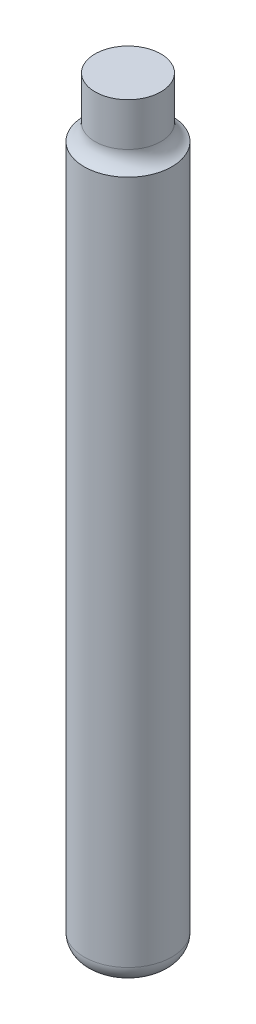
ISO-10303-21;
HEADER;
FILE_DESCRIPTION(('STEP AP214'),'2;1');
FILE_NAME('part.step','',(''),(''),'','','');
FILE_SCHEMA(('AUTOMOTIVE_DESIGN { 1 0 10303 214 1 1 1 1 }'));
ENDSEC;
DATA;
#1=APPLICATION_CONTEXT('core data for automotive mechanical design processes');
#2=APPLICATION_PROTOCOL_DEFINITION('international standard','automotive_design',2000,#1);
#3=PRODUCT_CONTEXT('',#1,'mechanical');
#4=PRODUCT('Part','Part','',(#3));
#5=PRODUCT_RELATED_PRODUCT_CATEGORY('part','',(#4));
#6=PRODUCT_DEFINITION_FORMATION('','',#4);
#7=PRODUCT_DEFINITION_CONTEXT('part definition',#1,'design');
#8=PRODUCT_DEFINITION('design','',#6,#7);
#9=PRODUCT_DEFINITION_SHAPE('','',#8);
#10=(LENGTH_UNIT() NAMED_UNIT(*) SI_UNIT(.MILLI.,.METRE.));
#11=(NAMED_UNIT(*) PLANE_ANGLE_UNIT() SI_UNIT($,.RADIAN.));
#12=(NAMED_UNIT(*) SI_UNIT($,.STERADIAN.) SOLID_ANGLE_UNIT());
#13=UNCERTAINTY_MEASURE_WITH_UNIT(LENGTH_MEASURE(1.E-05),#10,'distance_accuracy_value','');
#14=(GEOMETRIC_REPRESENTATION_CONTEXT(3) GLOBAL_UNCERTAINTY_ASSIGNED_CONTEXT((#13)) GLOBAL_UNIT_ASSIGNED_CONTEXT((#10,
#11,#12)) REPRESENTATION_CONTEXT('',''));
#15=CARTESIAN_POINT('',(0.,0.,0.));
#16=DIRECTION('',(0.,0.,1.));
#17=DIRECTION('',(1.,0.,0.));
#18=AXIS2_PLACEMENT_3D('',#15,#16,#17);
#19=CARTESIAN_POINT('',(0.,50.8,0.));
#20=DIRECTION('',(0.,-1.,0.));
#21=DIRECTION('',(0.,0.,-1.));
#22=AXIS2_PLACEMENT_3D('',#19,#20,#21);
#23=CYLINDRICAL_SURFACE('',#22,3.175);
#24=CARTESIAN_POINT('',(0.,1.27,0.));
#25=DIRECTION('',(0.,1.,0.));
#26=DIRECTION('',(0.,0.,1.));
#27=AXIS2_PLACEMENT_3D('',#24,#25,#26);
#28=CIRCLE('',#27,3.175);
#29=CARTESIAN_POINT('',(0.,1.27,3.175));
#30=VERTEX_POINT('',#29);
#31=EDGE_CURVE('E51',#30,#30,#28,.T.);
#32=ORIENTED_EDGE('',*,*,#31,.T.);
#33=EDGE_LOOP('',(#32));
#34=FACE_BOUND('',#33,.T.);
#35=CARTESIAN_POINT('',(0.,50.8,0.));
#36=DIRECTION('',(0.,1.,0.));
#37=DIRECTION('',(0.,0.,1.));
#38=AXIS2_PLACEMENT_3D('',#35,#36,#37);
#39=CIRCLE('',#38,3.175);
#40=CARTESIAN_POINT('',(0.,50.8,3.175));
#41=VERTEX_POINT('',#40);
#42=EDGE_CURVE('E48',#41,#41,#39,.T.);
#43=ORIENTED_EDGE('',*,*,#42,.F.);
#44=EDGE_LOOP('',(#43));
#45=FACE_BOUND('',#44,.T.);
#46=ADVANCED_FACE('F34',(#34,#45),#23,.T.);
#47=CARTESIAN_POINT('',(0.,0.,0.));
#48=DIRECTION('',(0.,1.,0.));
#49=DIRECTION('',(0.,0.,1.));
#50=AXIS2_PLACEMENT_3D('',#47,#48,#49);
#51=PLANE('',#50);
#52=CARTESIAN_POINT('',(0.,0.,0.));
#53=DIRECTION('',(0.,1.,0.));
#54=DIRECTION('',(0.,0.,1.));
#55=AXIS2_PLACEMENT_3D('',#52,#53,#54);
#56=CIRCLE('',#55,1.905);
#57=CARTESIAN_POINT('',(0.,0.,1.905));
#58=VERTEX_POINT('',#57);
#59=EDGE_CURVE('E41',#58,#58,#56,.F.);
#60=ORIENTED_EDGE('',*,*,#59,.T.);
#61=EDGE_LOOP('',(#60));
#62=FACE_BOUND('',#61,.T.);
#63=ADVANCED_FACE('F58',(#62),#51,.F.);
#64=CARTESIAN_POINT('',(0.,1.27,0.));
#65=DIRECTION('',(0.,1.,0.));
#66=DIRECTION('',(0.,0.,1.));
#67=AXIS2_PLACEMENT_3D('',#64,#65,#66);
#68=TOROIDAL_SURFACE('',#67,1.905,1.27);
#69=ORIENTED_EDGE('',*,*,#59,.F.);
#70=EDGE_LOOP('',(#69));
#71=FACE_BOUND('',#70,.T.);
#72=ORIENTED_EDGE('',*,*,#31,.F.);
#73=EDGE_LOOP('',(#72));
#74=FACE_BOUND('',#73,.T.);
#75=ADVANCED_FACE('F60',(#71,#74),#68,.T.);
#76=CARTESIAN_POINT('',(0.,55.0959623068477,0.));
#77=DIRECTION('',(0.,1.,0.));
#78=DIRECTION('',(0.,0.,1.));
#79=AXIS2_PLACEMENT_3D('',#76,#77,#78);
#80=PLANE('',#79);
#81=CARTESIAN_POINT('',(0.,55.0959623068477,0.));
#82=DIRECTION('',(0.,1.,0.));
#83=DIRECTION('',(0.,0.,1.));
#84=AXIS2_PLACEMENT_3D('',#81,#82,#83);
#85=CIRCLE('',#84,2.38125);
#86=CARTESIAN_POINT('',(0.,55.0959623068477,2.38125));
#87=VERTEX_POINT('',#86);
#88=EDGE_CURVE('E45',#87,#87,#85,.T.);
#89=ORIENTED_EDGE('',*,*,#88,.T.);
#90=EDGE_LOOP('',(#89));
#91=FACE_BOUND('',#90,.T.);
#92=ADVANCED_FACE('F46',(#91),#80,.T.);
#93=CARTESIAN_POINT('',(0.,50.8,0.));
#94=DIRECTION('',(0.,1.,0.));
#95=DIRECTION('',(0.,0.,1.));
#96=AXIS2_PLACEMENT_3D('',#93,#94,#95);
#97=CYLINDRICAL_SURFACE('',#96,2.38125);
#98=CARTESIAN_POINT('',(0.,51.9773215098264,0.));
#99=DIRECTION('',(0.,-1.,0.));
#100=DIRECTION('',(0.,0.,-1.));
#101=AXIS2_PLACEMENT_3D('',#98,#99,#100);
#102=CIRCLE('',#101,2.38125);
#103=CARTESIAN_POINT('',(0.,51.9773215098264,-2.38125));
#104=VERTEX_POINT('',#103);
#105=EDGE_CURVE('E11',#104,#104,#102,.F.);
#106=ORIENTED_EDGE('',*,*,#105,.T.);
#107=EDGE_LOOP('',(#106));
#108=FACE_BOUND('',#107,.T.);
#109=ORIENTED_EDGE('',*,*,#88,.F.);
#110=EDGE_LOOP('',(#109));
#111=FACE_BOUND('',#110,.T.);
#112=ADVANCED_FACE('F63',(#108,#111),#97,.T.);
#113=CARTESIAN_POINT('',(0.,51.9773215098264,0.));
#114=DIRECTION('',(0.,-1.,0.));
#115=DIRECTION('',(0.,0.,-1.));
#116=AXIS2_PLACEMENT_3D('',#113,#114,#115);
#117=TOROIDAL_SURFACE('',#116,3.65125,1.27);
#118=ORIENTED_EDGE('',*,*,#42,.T.);
#119=EDGE_LOOP('',(#118));
#120=FACE_BOUND('',#119,.T.);
#121=ORIENTED_EDGE('',*,*,#105,.F.);
#122=EDGE_LOOP('',(#121));
#123=FACE_BOUND('',#122,.T.);
#124=ADVANCED_FACE('F36',(#120,#123),#117,.F.);
#125=CLOSED_SHELL('',(#46,#63,#75,#92,#112,#124));
#126=MANIFOLD_SOLID_BREP('B2',#125);
#127=ADVANCED_BREP_SHAPE_REPRESENTATION('',(#18,#126),#14);
#128=SHAPE_DEFINITION_REPRESENTATION(#9,#127);
ENDSEC;
END-ISO-10303-21;
